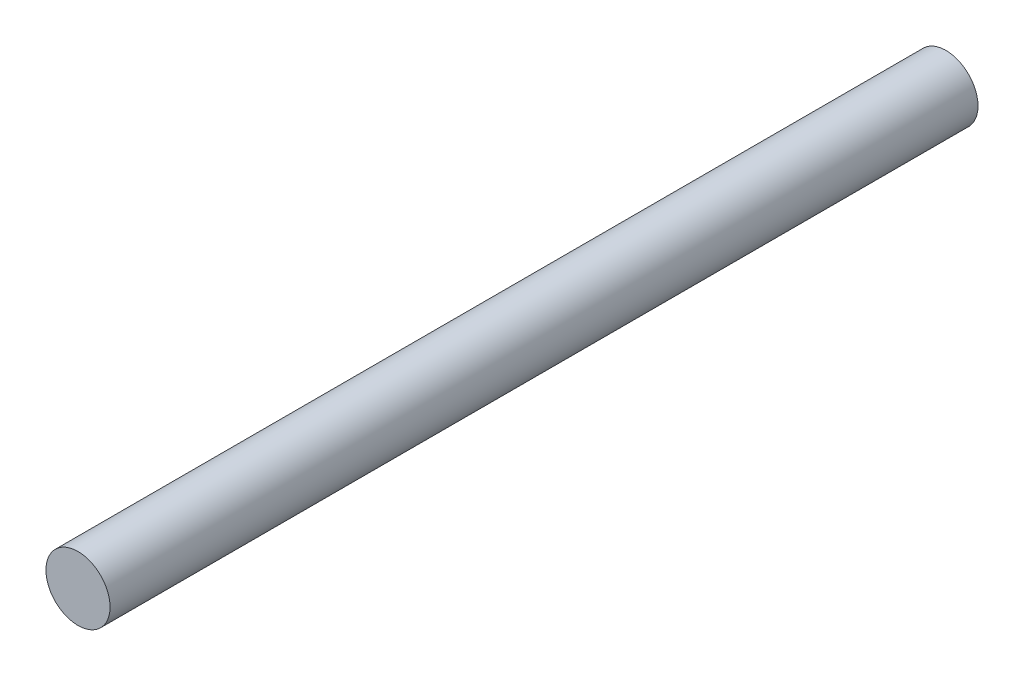
ISO-10303-21;
HEADER;
FILE_DESCRIPTION(('STEP AP214'),'2;1');
FILE_NAME('part.step','',(''),(''),'','','');
FILE_SCHEMA(('AUTOMOTIVE_DESIGN { 1 0 10303 214 1 1 1 1 }'));
ENDSEC;
DATA;
#1=APPLICATION_CONTEXT('core data for automotive mechanical design processes');
#2=APPLICATION_PROTOCOL_DEFINITION('international standard','automotive_design',2000,#1);
#3=PRODUCT_CONTEXT('',#1,'mechanical');
#4=PRODUCT('Part','Part','',(#3));
#5=PRODUCT_RELATED_PRODUCT_CATEGORY('part','',(#4));
#6=PRODUCT_DEFINITION_FORMATION('','',#4);
#7=PRODUCT_DEFINITION_CONTEXT('part definition',#1,'design');
#8=PRODUCT_DEFINITION('design','',#6,#7);
#9=PRODUCT_DEFINITION_SHAPE('','',#8);
#10=(LENGTH_UNIT() NAMED_UNIT(*) SI_UNIT(.MILLI.,.METRE.));
#11=(NAMED_UNIT(*) PLANE_ANGLE_UNIT() SI_UNIT($,.RADIAN.));
#12=(NAMED_UNIT(*) SI_UNIT($,.STERADIAN.) SOLID_ANGLE_UNIT());
#13=UNCERTAINTY_MEASURE_WITH_UNIT(LENGTH_MEASURE(1.E-05),#10,'distance_accuracy_value','');
#14=(GEOMETRIC_REPRESENTATION_CONTEXT(3) GLOBAL_UNCERTAINTY_ASSIGNED_CONTEXT((#13)) GLOBAL_UNIT_ASSIGNED_CONTEXT((#10,
#11,#12)) REPRESENTATION_CONTEXT('',''));
#15=CARTESIAN_POINT('',(0.,0.,0.));
#16=DIRECTION('',(0.,0.,1.));
#17=DIRECTION('',(1.,0.,0.));
#18=AXIS2_PLACEMENT_3D('',#15,#16,#17);
#19=CARTESIAN_POINT('',(0.,0.,157.));
#20=DIRECTION('',(0.,0.,-1.));
#21=DIRECTION('',(-1.,0.,0.));
#22=AXIS2_PLACEMENT_3D('',#19,#20,#21);
#23=CYLINDRICAL_SURFACE('',#22,5.8);
#24=CARTESIAN_POINT('',(0.,0.,157.));
#25=DIRECTION('',(0.,0.,1.));
#26=DIRECTION('',(1.,0.,0.));
#27=AXIS2_PLACEMENT_3D('',#24,#25,#26);
#28=CIRCLE('',#27,5.8);
#29=CARTESIAN_POINT('',(5.8,0.,157.));
#30=VERTEX_POINT('',#29);
#31=EDGE_CURVE('E10',#30,#30,#28,.T.);
#32=ORIENTED_EDGE('',*,*,#31,.F.);
#33=EDGE_LOOP('',(#32));
#34=FACE_BOUND('',#33,.T.);
#35=CARTESIAN_POINT('',(0.,0.,0.));
#36=DIRECTION('',(0.,0.,1.));
#37=DIRECTION('',(1.,0.,0.));
#38=AXIS2_PLACEMENT_3D('',#35,#36,#37);
#39=CIRCLE('',#38,5.8);
#40=CARTESIAN_POINT('',(5.8,0.,0.));
#41=VERTEX_POINT('',#40);
#42=EDGE_CURVE('E33',#41,#41,#39,.T.);
#43=ORIENTED_EDGE('',*,*,#42,.T.);
#44=EDGE_LOOP('',(#43));
#45=FACE_BOUND('',#44,.T.);
#46=ADVANCED_FACE('F30',(#34,#45),#23,.T.);
#47=CARTESIAN_POINT('',(0.,0.,157.));
#48=DIRECTION('',(0.,0.,1.));
#49=DIRECTION('',(1.,0.,0.));
#50=AXIS2_PLACEMENT_3D('',#47,#48,#49);
#51=PLANE('',#50);
#52=ORIENTED_EDGE('',*,*,#31,.T.);
#53=EDGE_LOOP('',(#52));
#54=FACE_BOUND('',#53,.T.);
#55=ADVANCED_FACE('F45',(#54),#51,.T.);
#56=CARTESIAN_POINT('',(0.,0.,0.));
#57=DIRECTION('',(0.,0.,1.));
#58=DIRECTION('',(1.,0.,0.));
#59=AXIS2_PLACEMENT_3D('',#56,#57,#58);
#60=PLANE('',#59);
#61=ORIENTED_EDGE('',*,*,#42,.F.);
#62=EDGE_LOOP('',(#61));
#63=FACE_BOUND('',#62,.T.);
#64=ADVANCED_FACE('F43',(#63),#60,.F.);
#65=CLOSED_SHELL('',(#46,#55,#64));
#66=MANIFOLD_SOLID_BREP('B2',#65);
#67=ADVANCED_BREP_SHAPE_REPRESENTATION('',(#18,#66),#14);
#68=SHAPE_DEFINITION_REPRESENTATION(#9,#67);
ENDSEC;
END-ISO-10303-21;
